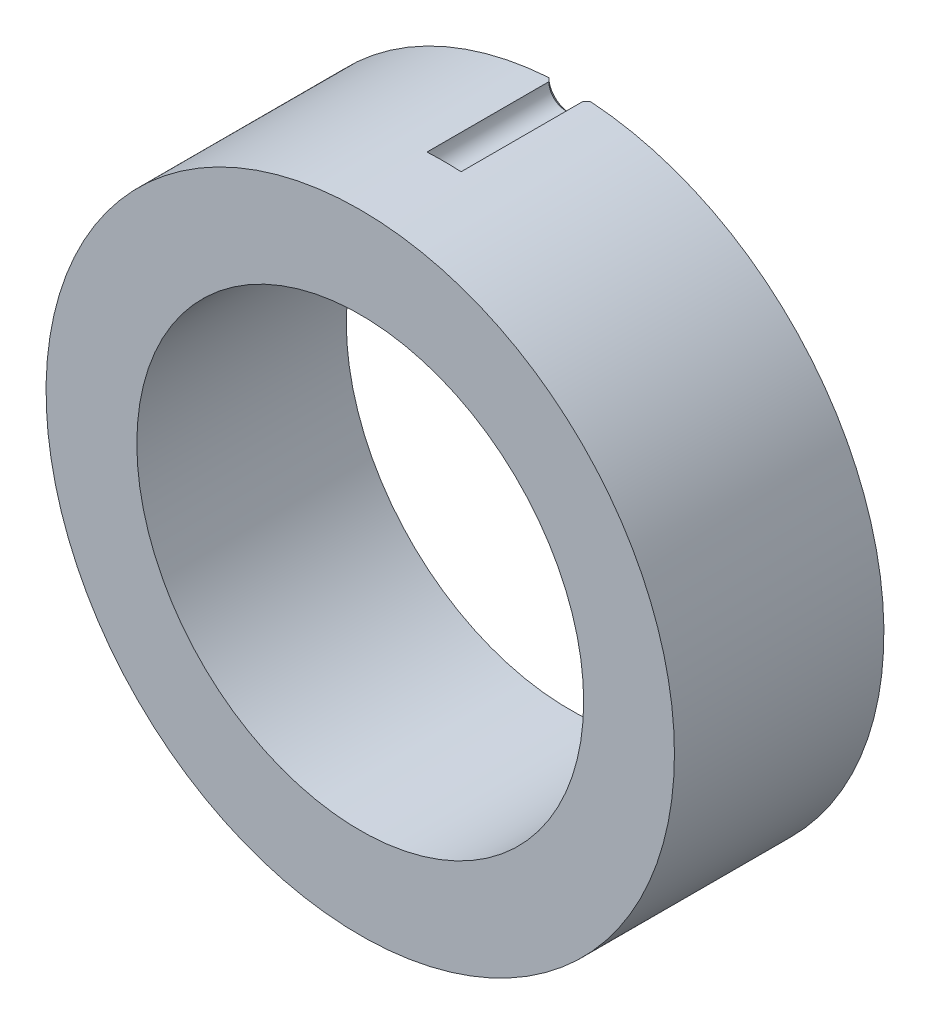
ISO-10303-21;
HEADER;
FILE_DESCRIPTION(('STEP AP214'),'2;1');
FILE_NAME('part.step','',(''),(''),'','','');
FILE_SCHEMA(('AUTOMOTIVE_DESIGN { 1 0 10303 214 1 1 1 1 }'));
ENDSEC;
DATA;
#1=APPLICATION_CONTEXT('core data for automotive mechanical design processes');
#2=APPLICATION_PROTOCOL_DEFINITION('international standard','automotive_design',2000,#1);
#3=PRODUCT_CONTEXT('',#1,'mechanical');
#4=PRODUCT('Part','Part','',(#3));
#5=PRODUCT_RELATED_PRODUCT_CATEGORY('part','',(#4));
#6=PRODUCT_DEFINITION_FORMATION('','',#4);
#7=PRODUCT_DEFINITION_CONTEXT('part definition',#1,'design');
#8=PRODUCT_DEFINITION('design','',#6,#7);
#9=PRODUCT_DEFINITION_SHAPE('','',#8);
#10=(LENGTH_UNIT() NAMED_UNIT(*) SI_UNIT(.MILLI.,.METRE.));
#11=(NAMED_UNIT(*) PLANE_ANGLE_UNIT() SI_UNIT($,.RADIAN.));
#12=(NAMED_UNIT(*) SI_UNIT($,.STERADIAN.) SOLID_ANGLE_UNIT());
#13=UNCERTAINTY_MEASURE_WITH_UNIT(LENGTH_MEASURE(1.E-05),#10,'distance_accuracy_value','');
#14=(GEOMETRIC_REPRESENTATION_CONTEXT(3) GLOBAL_UNCERTAINTY_ASSIGNED_CONTEXT((#13)) GLOBAL_UNIT_ASSIGNED_CONTEXT((#10,
#11,#12)) REPRESENTATION_CONTEXT('',''));
#15=CARTESIAN_POINT('',(0.,0.,0.));
#16=DIRECTION('',(0.,0.,1.));
#17=DIRECTION('',(1.,0.,0.));
#18=AXIS2_PLACEMENT_3D('',#15,#16,#17);
#19=CARTESIAN_POINT('',(0.,0.,30.));
#20=DIRECTION('',(0.,0.,1.));
#21=DIRECTION('',(1.,0.,0.));
#22=AXIS2_PLACEMENT_3D('',#19,#20,#21);
#23=PLANE('',#22);
#24=CARTESIAN_POINT('',(0.,0.,30.));
#25=DIRECTION('',(0.,0.,1.));
#26=DIRECTION('',(1.,0.,0.));
#27=AXIS2_PLACEMENT_3D('',#24,#25,#26);
#28=CIRCLE('',#27,45.);
#29=CARTESIAN_POINT('',(45.,0.,30.));
#30=VERTEX_POINT('',#29);
#31=EDGE_CURVE('E86',#30,#30,#28,.T.);
#32=ORIENTED_EDGE('',*,*,#31,.T.);
#33=EDGE_LOOP('',(#32));
#34=FACE_BOUND('',#33,.T.);
#35=CARTESIAN_POINT('',(0.,0.,30.));
#36=DIRECTION('',(0.,0.,1.));
#37=DIRECTION('',(1.,0.,0.));
#38=AXIS2_PLACEMENT_3D('',#35,#36,#37);
#39=CIRCLE('',#38,32.);
#40=CARTESIAN_POINT('',(32.,0.,30.));
#41=VERTEX_POINT('',#40);
#42=EDGE_CURVE('E92',#41,#41,#39,.T.);
#43=ORIENTED_EDGE('',*,*,#42,.F.);
#44=EDGE_LOOP('',(#43));
#45=FACE_BOUND('',#44,.T.);
#46=ADVANCED_FACE('F36',(#34,#45),#23,.T.);
#47=CARTESIAN_POINT('',(0.,0.,0.));
#48=DIRECTION('',(0.,0.,1.));
#49=DIRECTION('',(1.,0.,0.));
#50=AXIS2_PLACEMENT_3D('',#47,#48,#49);
#51=PLANE('',#50);
#52=CARTESIAN_POINT('',(0.,0.,0.));
#53=DIRECTION('',(0.,0.,1.));
#54=DIRECTION('',(1.,0.,0.));
#55=AXIS2_PLACEMENT_3D('',#52,#53,#54);
#56=CIRCLE('',#55,45.);
#57=CARTESIAN_POINT('',(-2.99833287011291,44.9,0.));
#58=VERTEX_POINT('',#57);
#59=CARTESIAN_POINT('',(2.99833287011301,44.9,0.));
#60=VERTEX_POINT('',#59);
#61=EDGE_CURVE('E96',#58,#60,#56,.T.);
#62=ORIENTED_EDGE('',*,*,#61,.F.);
#63=CARTESIAN_POINT('',(0.,45.,0.));
#64=DIRECTION('',(0.,0.,1.));
#65=DIRECTION('',(1.,0.,0.));
#66=AXIS2_PLACEMENT_3D('',#63,#64,#65);
#67=CIRCLE('',#66,3.00000000000002);
#68=EDGE_CURVE('E11',#58,#60,#67,.T.);
#69=ORIENTED_EDGE('',*,*,#68,.T.);
#70=EDGE_LOOP('',(#62,#69));
#71=FACE_BOUND('',#70,.T.);
#72=CARTESIAN_POINT('',(0.,0.,0.));
#73=DIRECTION('',(0.,0.,1.));
#74=DIRECTION('',(1.,0.,0.));
#75=AXIS2_PLACEMENT_3D('',#72,#73,#74);
#76=CIRCLE('',#75,32.);
#77=CARTESIAN_POINT('',(32.,0.,0.));
#78=VERTEX_POINT('',#77);
#79=EDGE_CURVE('E89',#78,#78,#76,.T.);
#80=ORIENTED_EDGE('',*,*,#79,.T.);
#81=EDGE_LOOP('',(#80));
#82=FACE_BOUND('',#81,.T.);
#83=ADVANCED_FACE('F113',(#71,#82),#51,.F.);
#84=CARTESIAN_POINT('',(0.,0.,30.));
#85=DIRECTION('',(0.,0.,-1.));
#86=DIRECTION('',(-1.,0.,0.));
#87=AXIS2_PLACEMENT_3D('',#84,#85,#86);
#88=CYLINDRICAL_SURFACE('',#87,45.);
#89=DIRECTION('',(0.,0.,-1.));
#90=VECTOR('',#89,1.);
#91=CARTESIAN_POINT('',(-2.44459704070645,44.9335503305555,9.));
#92=LINE('',#91,#90);
#93=CARTESIAN_POINT('',(-2.44459704070645,44.9335503305556,18.));
#94=VERTEX_POINT('',#93);
#95=CARTESIAN_POINT('',(-2.44459704070643,44.9335503305555,0.554500000000013));
#96=VERTEX_POINT('',#95);
#97=EDGE_CURVE('E80',#94,#96,#92,.T.);
#98=ORIENTED_EDGE('',*,*,#97,.T.);
#99=CARTESIAN_POINT('',(-2.44459704070643,44.9335503305555,0.554500000000013));
#100=CARTESIAN_POINT('',(-2.53691651026389,44.9285277372275,0.46207902099704));
#101=CARTESIAN_POINT('',(-2.6292208974907,44.923220579684,0.369660198164698));
#102=CARTESIAN_POINT('',(-2.81379950729289,44.9120371361656,0.18482686483136));
#103=CARTESIAN_POINT('',(-2.90607372986828,44.9061608501905,0.0924123543303639));
#104=CARTESIAN_POINT('',(-2.99833287011301,44.9,0.));
#105=B_SPLINE_CURVE_WITH_KNOTS('',3,(#99,#100,#101,#102,#103,#104),.UNSPECIFIED.,.F.,.F.,(4,2,
4),(0.,0.39218049636106,0.784360992764209),.UNSPECIFIED.);
#106=EDGE_CURVE('E45',#96,#58,#105,.T.);
#107=ORIENTED_EDGE('',*,*,#106,.T.);
#108=ORIENTED_EDGE('',*,*,#61,.T.);
#109=CARTESIAN_POINT('',(2.99833287011301,44.9,0.));
#110=CARTESIAN_POINT('',(2.90607372986828,44.9061608501905,0.0924123543303584));
#111=CARTESIAN_POINT('',(2.8137995072929,44.9120371361656,0.184826864831351));
#112=CARTESIAN_POINT('',(2.62922089749072,44.923220579684,0.369660198164687));
#113=CARTESIAN_POINT('',(2.53691651026392,44.9285277372275,0.46207902099703));
#114=CARTESIAN_POINT('',(2.44459704070647,44.9335503305556,0.554500000000006));
#115=B_SPLINE_CURVE_WITH_KNOTS('',3,(#109,#110,#111,#112,#113,#114),.UNSPECIFIED.,.F.,.F.,(4,2,
4),(0.,0.392180496403135,0.78436099276418),.UNSPECIFIED.);
#116=CARTESIAN_POINT('',(2.44459704070646,44.9335503305555,0.554500000000013));
#117=VERTEX_POINT('',#116);
#118=EDGE_CURVE('E74',#60,#117,#115,.T.);
#119=ORIENTED_EDGE('',*,*,#118,.T.);
#120=DIRECTION('',(0.,0.,-1.));
#121=VECTOR('',#120,1.);
#122=CARTESIAN_POINT('',(2.44459704070645,44.9335503305555,9.00000000000001));
#123=LINE('',#122,#121);
#124=CARTESIAN_POINT('',(2.44459704070645,44.9335503305556,18.));
#125=VERTEX_POINT('',#124);
#126=EDGE_CURVE('E68',#117,#125,#123,.F.);
#127=ORIENTED_EDGE('',*,*,#126,.T.);
#128=CARTESIAN_POINT('',(0.,0.,18.));
#129=DIRECTION('',(0.,0.,-1.));
#130=DIRECTION('',(-1.,0.,0.));
#131=AXIS2_PLACEMENT_3D('',#128,#129,#130);
#132=CIRCLE('',#131,45.);
#133=EDGE_CURVE('E72',#94,#125,#132,.T.);
#134=ORIENTED_EDGE('',*,*,#133,.F.);
#135=EDGE_LOOP('',(#98,#107,#108,#119,#127,#134));
#136=FACE_BOUND('',#135,.T.);
#137=ORIENTED_EDGE('',*,*,#31,.F.);
#138=EDGE_LOOP('',(#137));
#139=FACE_BOUND('',#138,.T.);
#140=ADVANCED_FACE('F70',(#136,#139),#88,.T.);
#141=CARTESIAN_POINT('',(0.,0.,30.));
#142=DIRECTION('',(0.,0.,-1.));
#143=DIRECTION('',(-1.,0.,0.));
#144=AXIS2_PLACEMENT_3D('',#141,#142,#143);
#145=CYLINDRICAL_SURFACE('',#144,32.);
#146=ORIENTED_EDGE('',*,*,#42,.T.);
#147=EDGE_LOOP('',(#146));
#148=FACE_BOUND('',#147,.T.);
#149=ORIENTED_EDGE('',*,*,#79,.F.);
#150=EDGE_LOOP('',(#149));
#151=FACE_BOUND('',#150,.T.);
#152=ADVANCED_FACE('F112',(#148,#151),#145,.F.);
#153=CARTESIAN_POINT('',(0.,45.,18.));
#154=DIRECTION('',(0.,0.,-1.));
#155=DIRECTION('',(-1.,0.,0.));
#156=AXIS2_PLACEMENT_3D('',#153,#154,#155);
#157=CYLINDRICAL_SURFACE('',#156,2.4455);
#158=ORIENTED_EDGE('',*,*,#126,.F.);
#159=CARTESIAN_POINT('',(0.,45.,0.554500000000013));
#160=DIRECTION('',(0.,0.,1.));
#161=DIRECTION('',(1.,0.,0.));
#162=AXIS2_PLACEMENT_3D('',#159,#160,#161);
#163=CIRCLE('',#162,2.4455);
#164=EDGE_CURVE('E79',#117,#96,#163,.F.);
#165=ORIENTED_EDGE('',*,*,#164,.T.);
#166=ORIENTED_EDGE('',*,*,#97,.F.);
#167=CARTESIAN_POINT('',(0.,45.,18.));
#168=DIRECTION('',(0.,0.,-1.));
#169=DIRECTION('',(-1.,0.,0.));
#170=AXIS2_PLACEMENT_3D('',#167,#168,#169);
#171=CIRCLE('',#170,2.4455);
#172=EDGE_CURVE('E84',#125,#94,#171,.T.);
#173=ORIENTED_EDGE('',*,*,#172,.F.);
#174=EDGE_LOOP('',(#158,#165,#166,#173));
#175=FACE_BOUND('',#174,.T.);
#176=ADVANCED_FACE('F88',(#175),#157,.F.);
#177=CARTESIAN_POINT('',(0.,45.,18.));
#178=DIRECTION('',(0.,0.,-1.));
#179=DIRECTION('',(-1.,0.,0.));
#180=AXIS2_PLACEMENT_3D('',#177,#178,#179);
#181=PLANE('',#180);
#182=ORIENTED_EDGE('',*,*,#133,.T.);
#183=ORIENTED_EDGE('',*,*,#172,.T.);
#184=EDGE_LOOP('',(#182,#183));
#185=FACE_BOUND('',#184,.T.);
#186=ADVANCED_FACE('F83',(#185),#181,.T.);
#187=CARTESIAN_POINT('',(0.,45.,0.554500000000013));
#188=DIRECTION('',(0.,0.,-1.));
#189=DIRECTION('',(-1.,0.,0.));
#190=AXIS2_PLACEMENT_3D('',#187,#188,#189);
#191=CONICAL_SURFACE('',#190,2.4455,0.785398163397454);
#192=ORIENTED_EDGE('',*,*,#118,.F.);
#193=ORIENTED_EDGE('',*,*,#68,.F.);
#194=ORIENTED_EDGE('',*,*,#106,.F.);
#195=ORIENTED_EDGE('',*,*,#164,.F.);
#196=EDGE_LOOP('',(#192,#193,#194,#195));
#197=FACE_BOUND('',#196,.T.);
#198=ADVANCED_FACE('F38',(#197),#191,.F.);
#199=CLOSED_SHELL('',(#46,#83,#140,#152,#176,#186,#198));
#200=MANIFOLD_SOLID_BREP('B2',#199);
#201=ADVANCED_BREP_SHAPE_REPRESENTATION('',(#18,#200),#14);
#202=SHAPE_DEFINITION_REPRESENTATION(#9,#201);
ENDSEC;
END-ISO-10303-21;
